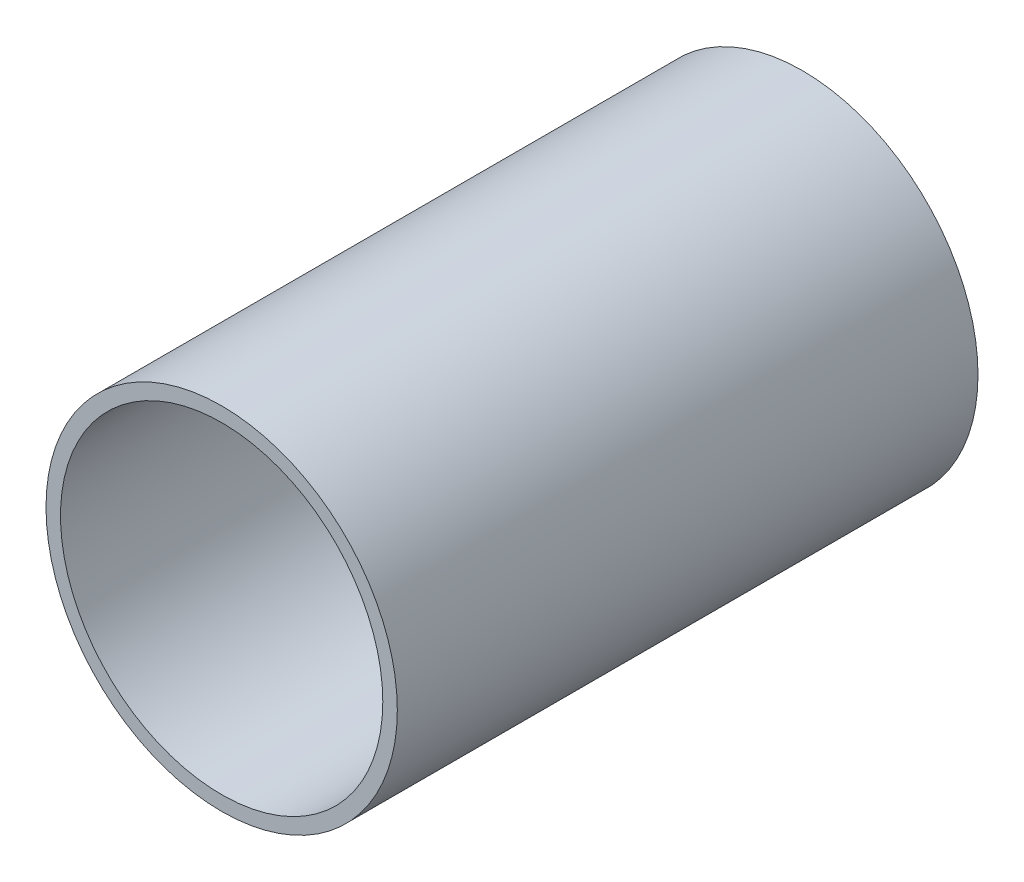
ISO-10303-21;
HEADER;
FILE_DESCRIPTION(('STEP AP214'),'2;1');
FILE_NAME('part.step','',(''),(''),'','','');
FILE_SCHEMA(('AUTOMOTIVE_DESIGN { 1 0 10303 214 1 1 1 1 }'));
ENDSEC;
DATA;
#1=APPLICATION_CONTEXT('core data for automotive mechanical design processes');
#2=APPLICATION_PROTOCOL_DEFINITION('international standard','automotive_design',2000,#1);
#3=PRODUCT_CONTEXT('',#1,'mechanical');
#4=PRODUCT('Part','Part','',(#3));
#5=PRODUCT_RELATED_PRODUCT_CATEGORY('part','',(#4));
#6=PRODUCT_DEFINITION_FORMATION('','',#4);
#7=PRODUCT_DEFINITION_CONTEXT('part definition',#1,'design');
#8=PRODUCT_DEFINITION('design','',#6,#7);
#9=PRODUCT_DEFINITION_SHAPE('','',#8);
#10=(LENGTH_UNIT() NAMED_UNIT(*) SI_UNIT(.MILLI.,.METRE.));
#11=(NAMED_UNIT(*) PLANE_ANGLE_UNIT() SI_UNIT($,.RADIAN.));
#12=(NAMED_UNIT(*) SI_UNIT($,.STERADIAN.) SOLID_ANGLE_UNIT());
#13=UNCERTAINTY_MEASURE_WITH_UNIT(LENGTH_MEASURE(1.E-05),#10,'distance_accuracy_value','');
#14=(GEOMETRIC_REPRESENTATION_CONTEXT(3) GLOBAL_UNCERTAINTY_ASSIGNED_CONTEXT((#13)) GLOBAL_UNIT_ASSIGNED_CONTEXT((#10,
#11,#12)) REPRESENTATION_CONTEXT('',''));
#15=CARTESIAN_POINT('',(0.,0.,0.));
#16=DIRECTION('',(0.,0.,1.));
#17=DIRECTION('',(1.,0.,0.));
#18=AXIS2_PLACEMENT_3D('',#15,#16,#17);
#19=CARTESIAN_POINT('',(0.,60.5,121.407575418994));
#20=DIRECTION('',(0.,0.,-1.));
#21=DIRECTION('',(-1.,0.,0.));
#22=AXIS2_PLACEMENT_3D('',#19,#20,#21);
#23=PLANE('',#22);
#24=CARTESIAN_POINT('',(0.,0.,121.407575418994));
#25=DIRECTION('',(0.,0.,1.));
#26=DIRECTION('',(1.,0.,0.));
#27=AXIS2_PLACEMENT_3D('',#24,#25,#26);
#28=CIRCLE('',#27,55.5);
#29=CARTESIAN_POINT('',(55.5,0.,121.407575418994));
#30=VERTEX_POINT('',#29);
#31=EDGE_CURVE('E10',#30,#30,#28,.T.);
#32=ORIENTED_EDGE('',*,*,#31,.F.);
#33=EDGE_LOOP('',(#32));
#34=FACE_BOUND('',#33,.T.);
#35=CARTESIAN_POINT('',(0.,0.,121.407575418994));
#36=DIRECTION('',(0.,0.,1.));
#37=DIRECTION('',(1.,0.,0.));
#38=AXIS2_PLACEMENT_3D('',#35,#36,#37);
#39=CIRCLE('',#38,60.5);
#40=CARTESIAN_POINT('',(60.5,0.,121.407575418994));
#41=VERTEX_POINT('',#40);
#42=EDGE_CURVE('E49',#41,#41,#39,.T.);
#43=ORIENTED_EDGE('',*,*,#42,.T.);
#44=EDGE_LOOP('',(#43));
#45=FACE_BOUND('',#44,.T.);
#46=ADVANCED_FACE('F35',(#34,#45),#23,.F.);
#47=CARTESIAN_POINT('',(0.,0.,72.9476648044693));
#48=DIRECTION('',(0.,0.,1.));
#49=DIRECTION('',(1.,0.,0.));
#50=AXIS2_PLACEMENT_3D('',#47,#48,#49);
#51=CYLINDRICAL_SURFACE('',#50,55.5);
#52=CARTESIAN_POINT('',(0.,0.,-78.5924245810056));
#53=DIRECTION('',(0.,0.,1.));
#54=DIRECTION('',(1.,0.,0.));
#55=AXIS2_PLACEMENT_3D('',#52,#53,#54);
#56=CIRCLE('',#55,55.5);
#57=CARTESIAN_POINT('',(55.5,0.,-78.5924245810056));
#58=VERTEX_POINT('',#57);
#59=EDGE_CURVE('E41',#58,#58,#56,.T.);
#60=ORIENTED_EDGE('',*,*,#59,.F.);
#61=EDGE_LOOP('',(#60));
#62=FACE_BOUND('',#61,.T.);
#63=ORIENTED_EDGE('',*,*,#31,.T.);
#64=EDGE_LOOP('',(#63));
#65=FACE_BOUND('',#64,.T.);
#66=ADVANCED_FACE('F64',(#62,#65),#51,.F.);
#67=CARTESIAN_POINT('',(0.,60.5,-78.5924245810056));
#68=DIRECTION('',(0.,0.,1.));
#69=DIRECTION('',(1.,0.,0.));
#70=AXIS2_PLACEMENT_3D('',#67,#68,#69);
#71=PLANE('',#70);
#72=CARTESIAN_POINT('',(0.,0.,-78.5924245810056));
#73=DIRECTION('',(0.,0.,1.));
#74=DIRECTION('',(1.,0.,0.));
#75=AXIS2_PLACEMENT_3D('',#72,#73,#74);
#76=CIRCLE('',#75,60.5);
#77=CARTESIAN_POINT('',(60.5,0.,-78.5924245810056));
#78=VERTEX_POINT('',#77);
#79=EDGE_CURVE('E45',#78,#78,#76,.T.);
#80=ORIENTED_EDGE('',*,*,#79,.F.);
#81=EDGE_LOOP('',(#80));
#82=FACE_BOUND('',#81,.T.);
#83=ORIENTED_EDGE('',*,*,#59,.T.);
#84=EDGE_LOOP('',(#83));
#85=FACE_BOUND('',#84,.T.);
#86=ADVANCED_FACE('F59',(#82,#85),#71,.F.);
#87=CARTESIAN_POINT('',(0.,0.,72.9476648044693));
#88=DIRECTION('',(0.,0.,1.));
#89=DIRECTION('',(1.,0.,0.));
#90=AXIS2_PLACEMENT_3D('',#87,#88,#89);
#91=CYLINDRICAL_SURFACE('',#90,60.5);
#92=ORIENTED_EDGE('',*,*,#42,.F.);
#93=EDGE_LOOP('',(#92));
#94=FACE_BOUND('',#93,.T.);
#95=ORIENTED_EDGE('',*,*,#79,.T.);
#96=EDGE_LOOP('',(#95));
#97=FACE_BOUND('',#96,.T.);
#98=ADVANCED_FACE('F56',(#94,#97),#91,.T.);
#99=CLOSED_SHELL('',(#46,#66,#86,#98));
#100=MANIFOLD_SOLID_BREP('B2',#99);
#101=ADVANCED_BREP_SHAPE_REPRESENTATION('',(#18,#100),#14);
#102=SHAPE_DEFINITION_REPRESENTATION(#9,#101);
ENDSEC;
END-ISO-10303-21;
